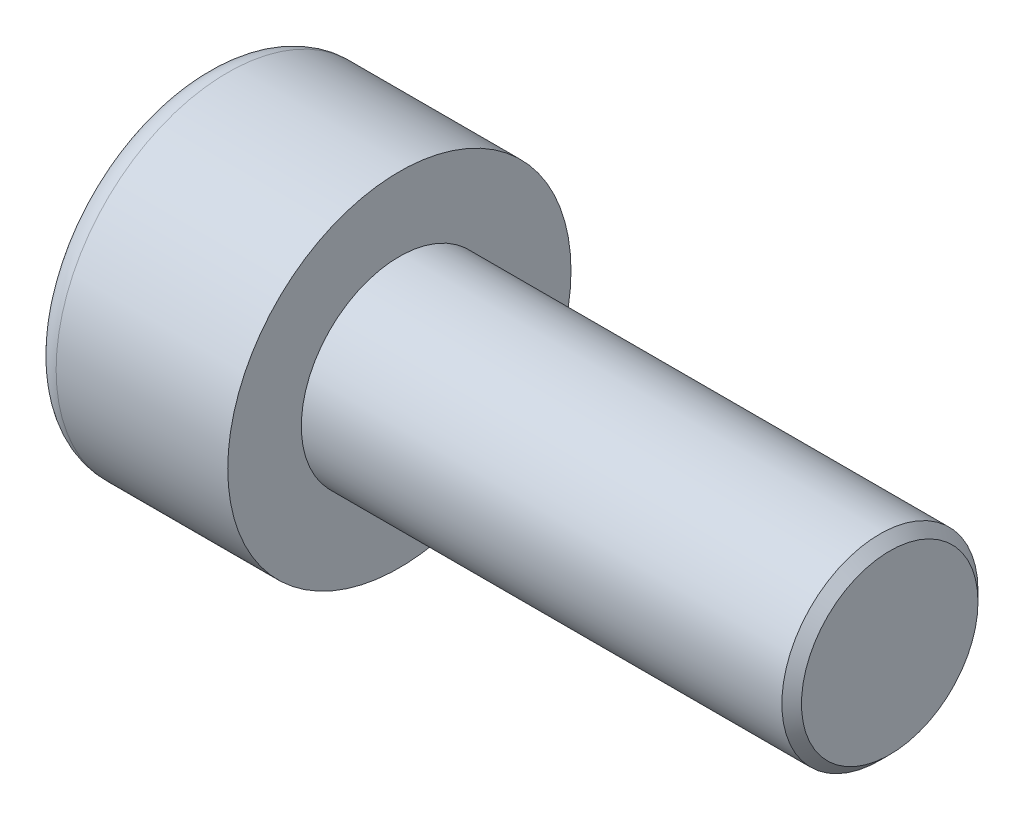
ISO-10303-21;
HEADER;
FILE_DESCRIPTION(('STEP AP214'),'2;1');
FILE_NAME('part.step','',(''),(''),'','','');
FILE_SCHEMA(('AUTOMOTIVE_DESIGN { 1 0 10303 214 1 1 1 1 }'));
ENDSEC;
DATA;
#1=APPLICATION_CONTEXT('core data for automotive mechanical design processes');
#2=APPLICATION_PROTOCOL_DEFINITION('international standard','automotive_design',2000,#1);
#3=PRODUCT_CONTEXT('',#1,'mechanical');
#4=PRODUCT('Part','Part','',(#3));
#5=PRODUCT_RELATED_PRODUCT_CATEGORY('part','',(#4));
#6=PRODUCT_DEFINITION_FORMATION('','',#4);
#7=PRODUCT_DEFINITION_CONTEXT('part definition',#1,'design');
#8=PRODUCT_DEFINITION('design','',#6,#7);
#9=PRODUCT_DEFINITION_SHAPE('','',#8);
#10=(LENGTH_UNIT() NAMED_UNIT(*) SI_UNIT(.MILLI.,.METRE.));
#11=(NAMED_UNIT(*) PLANE_ANGLE_UNIT() SI_UNIT($,.RADIAN.));
#12=(NAMED_UNIT(*) SI_UNIT($,.STERADIAN.) SOLID_ANGLE_UNIT());
#13=UNCERTAINTY_MEASURE_WITH_UNIT(LENGTH_MEASURE(1.E-05),#10,'distance_accuracy_value','');
#14=(GEOMETRIC_REPRESENTATION_CONTEXT(3) GLOBAL_UNCERTAINTY_ASSIGNED_CONTEXT((#13)) GLOBAL_UNIT_ASSIGNED_CONTEXT((#10,
#11,#12)) REPRESENTATION_CONTEXT('',''));
#15=CARTESIAN_POINT('',(0.,0.,0.));
#16=DIRECTION('',(0.,0.,1.));
#17=DIRECTION('',(1.,0.,0.));
#18=AXIS2_PLACEMENT_3D('',#15,#16,#17);
#19=CARTESIAN_POINT('',(2.,0.,-1.73205080756888));
#20=DIRECTION('',(1.,0.,0.));
#21=DIRECTION('',(0.,0.,-1.));
#22=AXIS2_PLACEMENT_3D('',#19,#20,#21);
#23=PLANE('',#22);
#24=CARTESIAN_POINT('',(2.,0.,0.));
#25=DIRECTION('',(1.,0.,0.));
#26=DIRECTION('',(0.,0.,-1.));
#27=AXIS2_PLACEMENT_3D('',#24,#25,#26);
#28=CIRCLE('',#27,1.5);
#29=CARTESIAN_POINT('',(2.,-0.75,-1.29903810567666));
#30=VERTEX_POINT('',#29);
#31=CARTESIAN_POINT('',(2.,-1.5,0.));
#32=VERTEX_POINT('',#31);
#33=EDGE_CURVE('E163',#30,#32,#28,.F.);
#34=ORIENTED_EDGE('',*,*,#33,.F.);
#35=DIRECTION('',(0.,0.866025403784439,-0.5));
#36=VECTOR('',#35,1.);
#37=CARTESIAN_POINT('',(2.,-1.5,-0.866025403784441));
#38=LINE('',#37,#36);
#39=CARTESIAN_POINT('',(2.,-1.5,-0.866025403784441));
#40=VERTEX_POINT('',#39);
#41=EDGE_CURVE('E171',#40,#30,#38,.T.);
#42=ORIENTED_EDGE('',*,*,#41,.F.);
#43=DIRECTION('',(0.,0.,-1.));
#44=VECTOR('',#43,1.);
#45=CARTESIAN_POINT('',(2.,-1.5,0.866025403784438));
#46=LINE('',#45,#44);
#47=EDGE_CURVE('E188',#32,#40,#46,.T.);
#48=ORIENTED_EDGE('',*,*,#47,.F.);
#49=EDGE_LOOP('',(#34,#42,#48));
#50=FACE_BOUND('',#49,.T.);
#51=ADVANCED_FACE('F40',(#50),#23,.F.);
#52=CARTESIAN_POINT('',(2.,-0.75,1.29903810567666));
#53=VERTEX_POINT('',#52);
#54=EDGE_CURVE('E293',#32,#53,#28,.F.);
#55=ORIENTED_EDGE('',*,*,#54,.F.);
#56=CARTESIAN_POINT('',(2.,-1.5,0.866025403784438));
#57=VERTEX_POINT('',#56);
#58=EDGE_CURVE('E189',#57,#32,#46,.T.);
#59=ORIENTED_EDGE('',*,*,#58,.F.);
#60=DIRECTION('',(0.,-0.866025403784439,-0.5));
#61=VECTOR('',#60,1.);
#62=CARTESIAN_POINT('',(2.,0.,1.73205080756888));
#63=LINE('',#62,#61);
#64=EDGE_CURVE('E184',#53,#57,#63,.T.);
#65=ORIENTED_EDGE('',*,*,#64,.F.);
#66=EDGE_LOOP('',(#55,#59,#65));
#67=FACE_BOUND('',#66,.T.);
#68=ADVANCED_FACE('F129',(#67),#23,.F.);
#69=CARTESIAN_POINT('',(2.,0.75,1.29903810567666));
#70=VERTEX_POINT('',#69);
#71=EDGE_CURVE('E289',#53,#70,#28,.F.);
#72=ORIENTED_EDGE('',*,*,#71,.F.);
#73=CARTESIAN_POINT('',(2.,0.,1.73205080756888));
#74=VERTEX_POINT('',#73);
#75=EDGE_CURVE('E185',#74,#53,#63,.T.);
#76=ORIENTED_EDGE('',*,*,#75,.F.);
#77=DIRECTION('',(0.,-0.866025403784439,0.5));
#78=VECTOR('',#77,1.);
#79=CARTESIAN_POINT('',(2.,1.5,0.866025403784439));
#80=LINE('',#79,#78);
#81=EDGE_CURVE('E180',#70,#74,#80,.T.);
#82=ORIENTED_EDGE('',*,*,#81,.F.);
#83=EDGE_LOOP('',(#72,#76,#82));
#84=FACE_BOUND('',#83,.T.);
#85=ADVANCED_FACE('F135',(#84),#23,.F.);
#86=CARTESIAN_POINT('',(2.,1.5,0.));
#87=VERTEX_POINT('',#86);
#88=EDGE_CURVE('E160',#70,#87,#28,.F.);
#89=ORIENTED_EDGE('',*,*,#88,.F.);
#90=CARTESIAN_POINT('',(2.,1.5,0.866025403784439));
#91=VERTEX_POINT('',#90);
#92=EDGE_CURVE('E181',#91,#70,#80,.T.);
#93=ORIENTED_EDGE('',*,*,#92,.F.);
#94=DIRECTION('',(0.,0.,1.));
#95=VECTOR('',#94,1.);
#96=CARTESIAN_POINT('',(2.,1.5,-0.866025403784438));
#97=LINE('',#96,#95);
#98=EDGE_CURVE('E175',#87,#91,#97,.T.);
#99=ORIENTED_EDGE('',*,*,#98,.F.);
#100=EDGE_LOOP('',(#89,#93,#99));
#101=FACE_BOUND('',#100,.T.);
#102=ADVANCED_FACE('F149',(#101),#23,.F.);
#103=CARTESIAN_POINT('',(2.,0.,0.));
#104=DIRECTION('',(1.,0.,0.));
#105=DIRECTION('',(0.,0.,-1.));
#106=AXIS2_PLACEMENT_3D('',#103,#104,#105);
#107=CIRCLE('',#106,1.5);
#108=CARTESIAN_POINT('',(2.,0.75,-1.29903810567666));
#109=VERTEX_POINT('',#108);
#110=EDGE_CURVE('E55',#109,#87,#107,.T.);
#111=ORIENTED_EDGE('',*,*,#110,.T.);
#112=CARTESIAN_POINT('',(2.,1.5,-0.866025403784438));
#113=VERTEX_POINT('',#112);
#114=EDGE_CURVE('E168',#113,#87,#97,.T.);
#115=ORIENTED_EDGE('',*,*,#114,.F.);
#116=DIRECTION('',(0.,0.866025403784438,0.5));
#117=VECTOR('',#116,1.);
#118=CARTESIAN_POINT('',(2.,0.,-1.73205080756888));
#119=LINE('',#118,#117);
#120=EDGE_CURVE('E165',#109,#113,#119,.T.);
#121=ORIENTED_EDGE('',*,*,#120,.F.);
#122=EDGE_LOOP('',(#111,#115,#121));
#123=FACE_BOUND('',#122,.T.);
#124=ADVANCED_FACE('F140',(#123),#23,.F.);
#125=EDGE_CURVE('E153',#109,#30,#28,.F.);
#126=ORIENTED_EDGE('',*,*,#125,.F.);
#127=CARTESIAN_POINT('',(2.,0.,-1.73205080756888));
#128=VERTEX_POINT('',#127);
#129=EDGE_CURVE('E156',#128,#109,#119,.T.);
#130=ORIENTED_EDGE('',*,*,#129,.F.);
#131=EDGE_CURVE('E158',#30,#128,#38,.T.);
#132=ORIENTED_EDGE('',*,*,#131,.F.);
#133=EDGE_LOOP('',(#126,#130,#132));
#134=FACE_BOUND('',#133,.T.);
#135=ADVANCED_FACE('F131',(#134),#23,.F.);
#136=CARTESIAN_POINT('',(0.,0.,0.));
#137=DIRECTION('',(1.,0.,0.));
#138=DIRECTION('',(0.,0.,-1.));
#139=AXIS2_PLACEMENT_3D('',#136,#137,#138);
#140=PLANE('',#139);
#141=CARTESIAN_POINT('',(0.,0.,0.));
#142=DIRECTION('',(1.,0.,0.));
#143=DIRECTION('',(0.,0.,-1.));
#144=AXIS2_PLACEMENT_3D('',#141,#142,#143);
#145=CIRCLE('',#144,3.);
#146=CARTESIAN_POINT('',(0.,0.,-3.));
#147=VERTEX_POINT('',#146);
#148=EDGE_CURVE('E228',#147,#147,#145,.F.);
#149=ORIENTED_EDGE('',*,*,#148,.T.);
#150=EDGE_LOOP('',(#149));
#151=FACE_BOUND('',#150,.T.);
#152=DIRECTION('',(0.,0.866025403784439,-0.5));
#153=VECTOR('',#152,1.);
#154=CARTESIAN_POINT('',(0.,-1.5,-0.866025403784441));
#155=LINE('',#154,#153);
#156=CARTESIAN_POINT('',(0.,-1.5,-0.866025403784441));
#157=VERTEX_POINT('',#156);
#158=CARTESIAN_POINT('',(0.,0.,-1.73205080756888));
#159=VERTEX_POINT('',#158);
#160=EDGE_CURVE('E63',#157,#159,#155,.T.);
#161=ORIENTED_EDGE('',*,*,#160,.T.);
#162=DIRECTION('',(0.,0.866025403784438,0.5));
#163=VECTOR('',#162,1.);
#164=CARTESIAN_POINT('',(0.,0.,-1.73205080756888));
#165=LINE('',#164,#163);
#166=CARTESIAN_POINT('',(0.,1.5,-0.866025403784438));
#167=VERTEX_POINT('',#166);
#168=EDGE_CURVE('E194',#159,#167,#165,.T.);
#169=ORIENTED_EDGE('',*,*,#168,.T.);
#170=DIRECTION('',(0.,0.,1.));
#171=VECTOR('',#170,1.);
#172=CARTESIAN_POINT('',(0.,1.5,-0.866025403784438));
#173=LINE('',#172,#171);
#174=CARTESIAN_POINT('',(0.,1.5,0.866025403784439));
#175=VERTEX_POINT('',#174);
#176=EDGE_CURVE('E197',#167,#175,#173,.T.);
#177=ORIENTED_EDGE('',*,*,#176,.T.);
#178=DIRECTION('',(0.,-0.866025403784439,0.5));
#179=VECTOR('',#178,1.);
#180=CARTESIAN_POINT('',(0.,1.5,0.866025403784439));
#181=LINE('',#180,#179);
#182=CARTESIAN_POINT('',(0.,0.,1.73205080756888));
#183=VERTEX_POINT('',#182);
#184=EDGE_CURVE('E200',#175,#183,#181,.T.);
#185=ORIENTED_EDGE('',*,*,#184,.T.);
#186=DIRECTION('',(0.,-0.866025403784439,-0.5));
#187=VECTOR('',#186,1.);
#188=CARTESIAN_POINT('',(0.,0.,1.73205080756888));
#189=LINE('',#188,#187);
#190=CARTESIAN_POINT('',(0.,-1.5,0.866025403784438));
#191=VERTEX_POINT('',#190);
#192=EDGE_CURVE('E203',#183,#191,#189,.T.);
#193=ORIENTED_EDGE('',*,*,#192,.T.);
#194=DIRECTION('',(0.,0.,-1.));
#195=VECTOR('',#194,1.);
#196=CARTESIAN_POINT('',(0.,-1.5,0.866025403784438));
#197=LINE('',#196,#195);
#198=EDGE_CURVE('E206',#191,#157,#197,.T.);
#199=ORIENTED_EDGE('',*,*,#198,.T.);
#200=EDGE_LOOP('',(#161,#169,#177,#185,#193,#199));
#201=FACE_BOUND('',#200,.T.);
#202=ADVANCED_FACE('F139',(#151,#201),#140,.F.);
#203=CARTESIAN_POINT('',(4.,0.,0.));
#204=DIRECTION('',(1.,0.,0.));
#205=DIRECTION('',(0.,0.,-1.));
#206=AXIS2_PLACEMENT_3D('',#203,#204,#205);
#207=PLANE('',#206);
#208=CARTESIAN_POINT('',(4.,0.,0.));
#209=DIRECTION('',(1.,0.,0.));
#210=DIRECTION('',(0.,0.,-1.));
#211=AXIS2_PLACEMENT_3D('',#208,#209,#210);
#212=CIRCLE('',#211,3.5);
#213=CARTESIAN_POINT('',(4.,0.,-3.5));
#214=VERTEX_POINT('',#213);
#215=EDGE_CURVE('E161',#214,#214,#212,.T.);
#216=ORIENTED_EDGE('',*,*,#215,.T.);
#217=EDGE_LOOP('',(#216));
#218=FACE_BOUND('',#217,.T.);
#219=CARTESIAN_POINT('',(4.,0.,0.));
#220=DIRECTION('',(1.,0.,0.));
#221=DIRECTION('',(0.,0.,-1.));
#222=AXIS2_PLACEMENT_3D('',#219,#220,#221);
#223=CIRCLE('',#222,2.);
#224=CARTESIAN_POINT('',(4.,0.,-2.));
#225=VERTEX_POINT('',#224);
#226=EDGE_CURVE('E219',#225,#225,#223,.T.);
#227=ORIENTED_EDGE('',*,*,#226,.F.);
#228=EDGE_LOOP('',(#227));
#229=FACE_BOUND('',#228,.T.);
#230=ADVANCED_FACE('F146',(#218,#229),#207,.T.);
#231=CARTESIAN_POINT('',(4.,0.,0.));
#232=DIRECTION('',(-1.,0.,0.));
#233=DIRECTION('',(0.,0.,1.));
#234=AXIS2_PLACEMENT_3D('',#231,#232,#233);
#235=CYLINDRICAL_SURFACE('',#234,3.5);
#236=CARTESIAN_POINT('',(0.5,0.,0.));
#237=DIRECTION('',(1.,0.,0.));
#238=DIRECTION('',(0.,0.,-1.));
#239=AXIS2_PLACEMENT_3D('',#236,#237,#238);
#240=CIRCLE('',#239,3.5);
#241=CARTESIAN_POINT('',(0.5,0.,-3.5));
#242=VERTEX_POINT('',#241);
#243=EDGE_CURVE('E225',#242,#242,#240,.T.);
#244=ORIENTED_EDGE('',*,*,#243,.T.);
#245=EDGE_LOOP('',(#244));
#246=FACE_BOUND('',#245,.T.);
#247=ORIENTED_EDGE('',*,*,#215,.F.);
#248=EDGE_LOOP('',(#247));
#249=FACE_BOUND('',#248,.T.);
#250=ADVANCED_FACE('F244',(#246,#249),#235,.T.);
#251=CARTESIAN_POINT('',(14.,0.,0.));
#252=DIRECTION('',(-1.,0.,0.));
#253=DIRECTION('',(0.,0.,1.));
#254=AXIS2_PLACEMENT_3D('',#251,#252,#253);
#255=CYLINDRICAL_SURFACE('',#254,2.);
#256=CARTESIAN_POINT('',(13.8,0.,0.));
#257=DIRECTION('',(1.,0.,0.));
#258=DIRECTION('',(0.,0.,-1.));
#259=AXIS2_PLACEMENT_3D('',#256,#257,#258);
#260=CIRCLE('',#259,2.);
#261=CARTESIAN_POINT('',(13.8,0.,-2.));
#262=VERTEX_POINT('',#261);
#263=EDGE_CURVE('E11',#262,#262,#260,.F.);
#264=ORIENTED_EDGE('',*,*,#263,.T.);
#265=EDGE_LOOP('',(#264));
#266=FACE_BOUND('',#265,.T.);
#267=ORIENTED_EDGE('',*,*,#226,.T.);
#268=EDGE_LOOP('',(#267));
#269=FACE_BOUND('',#268,.T.);
#270=ADVANCED_FACE('F241',(#266,#269),#255,.T.);
#271=CARTESIAN_POINT('',(14.,0.,0.));
#272=DIRECTION('',(1.,0.,0.));
#273=DIRECTION('',(0.,0.,-1.));
#274=AXIS2_PLACEMENT_3D('',#271,#272,#273);
#275=PLANE('',#274);
#276=CARTESIAN_POINT('',(14.,0.,0.));
#277=DIRECTION('',(1.,0.,0.));
#278=DIRECTION('',(0.,0.,-1.));
#279=AXIS2_PLACEMENT_3D('',#276,#277,#278);
#280=CIRCLE('',#279,1.8);
#281=CARTESIAN_POINT('',(14.,0.,-1.8));
#282=VERTEX_POINT('',#281);
#283=EDGE_CURVE('E48',#282,#282,#280,.T.);
#284=ORIENTED_EDGE('',*,*,#283,.T.);
#285=EDGE_LOOP('',(#284));
#286=FACE_BOUND('',#285,.T.);
#287=ADVANCED_FACE('F233',(#286),#275,.T.);
#288=CARTESIAN_POINT('',(2.,-1.5,-0.866025403784441));
#289=DIRECTION('',(0.,0.5,0.866025403784439));
#290=DIRECTION('',(0.,-0.866025403784439,0.5));
#291=AXIS2_PLACEMENT_3D('',#288,#289,#290);
#292=PLANE('',#291);
#293=ORIENTED_EDGE('',*,*,#160,.F.);
#294=DIRECTION('',(-1.,0.,0.));
#295=VECTOR('',#294,1.);
#296=CARTESIAN_POINT('',(2.,-1.5,-0.866025403784441));
#297=LINE('',#296,#295);
#298=EDGE_CURVE('E192',#40,#157,#297,.T.);
#299=ORIENTED_EDGE('',*,*,#298,.F.);
#300=ORIENTED_EDGE('',*,*,#41,.T.);
#301=ORIENTED_EDGE('',*,*,#131,.T.);
#302=DIRECTION('',(-1.,0.,0.));
#303=VECTOR('',#302,1.);
#304=CARTESIAN_POINT('',(2.,0.,-1.73205080756888));
#305=LINE('',#304,#303);
#306=EDGE_CURVE('E174',#128,#159,#305,.T.);
#307=ORIENTED_EDGE('',*,*,#306,.T.);
#308=EDGE_LOOP('',(#293,#299,#300,#301,#307));
#309=FACE_BOUND('',#308,.T.);
#310=ADVANCED_FACE('F259',(#309),#292,.T.);
#311=CARTESIAN_POINT('',(2.,0.,-1.73205080756888));
#312=DIRECTION('',(0.,-0.5,0.866025403784438));
#313=DIRECTION('',(0.,-0.866025403784438,-0.5));
#314=AXIS2_PLACEMENT_3D('',#311,#312,#313);
#315=PLANE('',#314);
#316=ORIENTED_EDGE('',*,*,#168,.F.);
#317=ORIENTED_EDGE('',*,*,#306,.F.);
#318=ORIENTED_EDGE('',*,*,#129,.T.);
#319=ORIENTED_EDGE('',*,*,#120,.T.);
#320=DIRECTION('',(-1.,0.,0.));
#321=VECTOR('',#320,1.);
#322=CARTESIAN_POINT('',(2.,1.5,-0.866025403784438));
#323=LINE('',#322,#321);
#324=EDGE_CURVE('E216',#113,#167,#323,.T.);
#325=ORIENTED_EDGE('',*,*,#324,.T.);
#326=EDGE_LOOP('',(#316,#317,#318,#319,#325));
#327=FACE_BOUND('',#326,.T.);
#328=ADVANCED_FACE('F173',(#327),#315,.T.);
#329=CARTESIAN_POINT('',(2.,1.5,-0.866025403784438));
#330=DIRECTION('',(0.,-1.,0.));
#331=DIRECTION('',(0.,0.,-1.));
#332=AXIS2_PLACEMENT_3D('',#329,#330,#331);
#333=PLANE('',#332);
#334=ORIENTED_EDGE('',*,*,#176,.F.);
#335=ORIENTED_EDGE('',*,*,#324,.F.);
#336=ORIENTED_EDGE('',*,*,#114,.T.);
#337=ORIENTED_EDGE('',*,*,#98,.T.);
#338=DIRECTION('',(-1.,0.,0.));
#339=VECTOR('',#338,1.);
#340=CARTESIAN_POINT('',(2.,1.5,0.866025403784439));
#341=LINE('',#340,#339);
#342=EDGE_CURVE('E214',#91,#175,#341,.T.);
#343=ORIENTED_EDGE('',*,*,#342,.T.);
#344=EDGE_LOOP('',(#334,#335,#336,#337,#343));
#345=FACE_BOUND('',#344,.T.);
#346=ADVANCED_FACE('F264',(#345),#333,.T.);
#347=CARTESIAN_POINT('',(2.,1.5,0.866025403784439));
#348=DIRECTION('',(0.,-0.5,-0.866025403784439));
#349=DIRECTION('',(0.,0.866025403784439,-0.5));
#350=AXIS2_PLACEMENT_3D('',#347,#348,#349);
#351=PLANE('',#350);
#352=ORIENTED_EDGE('',*,*,#184,.F.);
#353=ORIENTED_EDGE('',*,*,#342,.F.);
#354=ORIENTED_EDGE('',*,*,#92,.T.);
#355=ORIENTED_EDGE('',*,*,#81,.T.);
#356=DIRECTION('',(-1.,0.,0.));
#357=VECTOR('',#356,1.);
#358=CARTESIAN_POINT('',(2.,0.,1.73205080756888));
#359=LINE('',#358,#357);
#360=EDGE_CURVE('E212',#74,#183,#359,.T.);
#361=ORIENTED_EDGE('',*,*,#360,.T.);
#362=EDGE_LOOP('',(#352,#353,#354,#355,#361));
#363=FACE_BOUND('',#362,.T.);
#364=ADVANCED_FACE('F267',(#363),#351,.T.);
#365=CARTESIAN_POINT('',(2.,0.,1.73205080756888));
#366=DIRECTION('',(0.,0.5,-0.866025403784439));
#367=DIRECTION('',(0.,0.866025403784439,0.5));
#368=AXIS2_PLACEMENT_3D('',#365,#366,#367);
#369=PLANE('',#368);
#370=ORIENTED_EDGE('',*,*,#192,.F.);
#371=ORIENTED_EDGE('',*,*,#360,.F.);
#372=ORIENTED_EDGE('',*,*,#75,.T.);
#373=ORIENTED_EDGE('',*,*,#64,.T.);
#374=DIRECTION('',(-1.,0.,0.));
#375=VECTOR('',#374,1.);
#376=CARTESIAN_POINT('',(2.,-1.5,0.866025403784438));
#377=LINE('',#376,#375);
#378=EDGE_CURVE('E210',#57,#191,#377,.T.);
#379=ORIENTED_EDGE('',*,*,#378,.T.);
#380=EDGE_LOOP('',(#370,#371,#372,#373,#379));
#381=FACE_BOUND('',#380,.T.);
#382=ADVANCED_FACE('F124',(#381),#369,.T.);
#383=CARTESIAN_POINT('',(2.,-1.5,0.866025403784438));
#384=DIRECTION('',(0.,1.,0.));
#385=DIRECTION('',(0.,0.,1.));
#386=AXIS2_PLACEMENT_3D('',#383,#384,#385);
#387=PLANE('',#386);
#388=ORIENTED_EDGE('',*,*,#198,.F.);
#389=ORIENTED_EDGE('',*,*,#378,.F.);
#390=ORIENTED_EDGE('',*,*,#58,.T.);
#391=ORIENTED_EDGE('',*,*,#47,.T.);
#392=ORIENTED_EDGE('',*,*,#298,.T.);
#393=EDGE_LOOP('',(#388,#389,#390,#391,#392));
#394=FACE_BOUND('',#393,.T.);
#395=ADVANCED_FACE('F117',(#394),#387,.T.);
#396=CARTESIAN_POINT('',(2.,0.,0.));
#397=DIRECTION('',(-1.,0.,0.));
#398=DIRECTION('',(0.,0.,1.));
#399=AXIS2_PLACEMENT_3D('',#396,#397,#398);
#400=CONICAL_SURFACE('',#399,1.5,1.04719755119659);
#401=CARTESIAN_POINT('',(2.86602540378445,0.,0.));
#402=VERTEX_POINT('',#401);
#403=VERTEX_LOOP('',#402);
#404=FACE_BOUND('',#403,.T.);
#405=ORIENTED_EDGE('',*,*,#110,.F.);
#406=ORIENTED_EDGE('',*,*,#125,.T.);
#407=ORIENTED_EDGE('',*,*,#33,.T.);
#408=ORIENTED_EDGE('',*,*,#54,.T.);
#409=ORIENTED_EDGE('',*,*,#71,.T.);
#410=ORIENTED_EDGE('',*,*,#88,.T.);
#411=EDGE_LOOP('',(#405,#406,#407,#408,#409,#410));
#412=FACE_BOUND('',#411,.T.);
#413=ADVANCED_FACE('F114',(#404,#412),#400,.F.);
#414=CARTESIAN_POINT('',(0.5,0.,0.));
#415=DIRECTION('',(1.,0.,0.));
#416=DIRECTION('',(0.,0.,-1.));
#417=AXIS2_PLACEMENT_3D('',#414,#415,#416);
#418=TOROIDAL_SURFACE('',#417,3.,0.5);
#419=ORIENTED_EDGE('',*,*,#148,.F.);
#420=EDGE_LOOP('',(#419));
#421=FACE_BOUND('',#420,.T.);
#422=ORIENTED_EDGE('',*,*,#243,.F.);
#423=EDGE_LOOP('',(#422));
#424=FACE_BOUND('',#423,.T.);
#425=ADVANCED_FACE('F116',(#421,#424),#418,.T.);
#426=CARTESIAN_POINT('',(14.,0.,0.));
#427=DIRECTION('',(-1.,0.,0.));
#428=DIRECTION('',(0.,0.,1.));
#429=AXIS2_PLACEMENT_3D('',#426,#427,#428);
#430=CONICAL_SURFACE('',#429,1.8,0.78539816339744);
#431=ORIENTED_EDGE('',*,*,#263,.F.);
#432=EDGE_LOOP('',(#431));
#433=FACE_BOUND('',#432,.T.);
#434=ORIENTED_EDGE('',*,*,#283,.F.);
#435=EDGE_LOOP('',(#434));
#436=FACE_BOUND('',#435,.T.);
#437=ADVANCED_FACE('F42',(#433,#436),#430,.T.);
#438=CLOSED_SHELL('',(#51,#68,#85,#102,#124,#135,#202,#230,#250,#270,#287,#310,#328,#346,#364,
#382,#395,#413,#425,#437));
#439=MANIFOLD_SOLID_BREP('B2',#438);
#440=ADVANCED_BREP_SHAPE_REPRESENTATION('',(#18,#439),#14);
#441=SHAPE_DEFINITION_REPRESENTATION(#9,#440);
ENDSEC;
END-ISO-10303-21;
